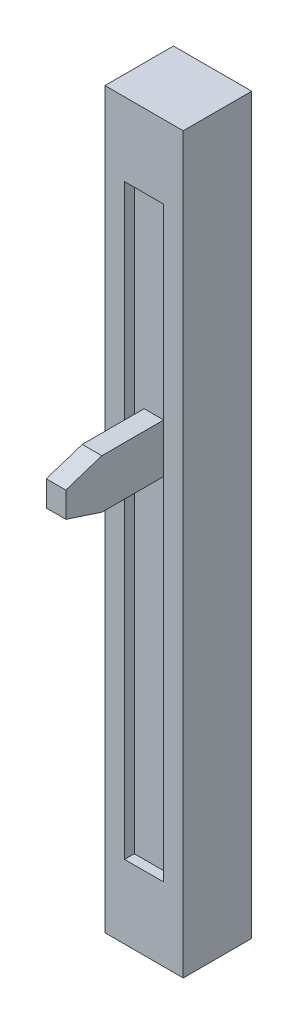
ISO-10303-21;
HEADER;
FILE_DESCRIPTION(('STEP AP214'),'2;1');
FILE_NAME('part.step','',(''),(''),'','','');
FILE_SCHEMA(('AUTOMOTIVE_DESIGN { 1 0 10303 214 1 1 1 1 }'));
ENDSEC;
DATA;
#1=APPLICATION_CONTEXT('core data for automotive mechanical design processes');
#2=APPLICATION_PROTOCOL_DEFINITION('international standard','automotive_design',2000,#1);
#3=PRODUCT_CONTEXT('',#1,'mechanical');
#4=PRODUCT('Part','Part','',(#3));
#5=PRODUCT_RELATED_PRODUCT_CATEGORY('part','',(#4));
#6=PRODUCT_DEFINITION_FORMATION('','',#4);
#7=PRODUCT_DEFINITION_CONTEXT('part definition',#1,'design');
#8=PRODUCT_DEFINITION('design','',#6,#7);
#9=PRODUCT_DEFINITION_SHAPE('','',#8);
#10=(LENGTH_UNIT() NAMED_UNIT(*) SI_UNIT(.MILLI.,.METRE.));
#11=(NAMED_UNIT(*) PLANE_ANGLE_UNIT() SI_UNIT($,.RADIAN.));
#12=(NAMED_UNIT(*) SI_UNIT($,.STERADIAN.) SOLID_ANGLE_UNIT());
#13=UNCERTAINTY_MEASURE_WITH_UNIT(LENGTH_MEASURE(1.E-05),#10,'distance_accuracy_value','');
#14=(GEOMETRIC_REPRESENTATION_CONTEXT(3) GLOBAL_UNCERTAINTY_ASSIGNED_CONTEXT((#13)) GLOBAL_UNIT_ASSIGNED_CONTEXT((#10,
#11,#12)) REPRESENTATION_CONTEXT('',''));
#15=CARTESIAN_POINT('',(0.,0.,0.));
#16=DIRECTION('',(0.,0.,1.));
#17=DIRECTION('',(1.,0.,0.));
#18=AXIS2_PLACEMENT_3D('',#15,#16,#17);
#19=CARTESIAN_POINT('',(4.,-37.5,7.));
#20=DIRECTION('',(-1.,0.,0.));
#21=DIRECTION('',(0.,0.,1.));
#22=AXIS2_PLACEMENT_3D('',#19,#20,#21);
#23=PLANE('',#22);
#24=DIRECTION('',(0.,1.,0.));
#25=VECTOR('',#24,1.);
#26=CARTESIAN_POINT('',(4.,-37.5,0.));
#27=LINE('',#26,#25);
#28=CARTESIAN_POINT('',(4.,-37.5,0.));
#29=VERTEX_POINT('',#28);
#30=CARTESIAN_POINT('',(4.,37.5,0.));
#31=VERTEX_POINT('',#30);
#32=EDGE_CURVE('E197',#29,#31,#27,.T.);
#33=ORIENTED_EDGE('',*,*,#32,.T.);
#34=DIRECTION('',(0.,0.,-1.));
#35=VECTOR('',#34,1.);
#36=CARTESIAN_POINT('',(4.,37.5,7.));
#37=LINE('',#36,#35);
#38=CARTESIAN_POINT('',(4.,37.5,7.));
#39=VERTEX_POINT('',#38);
#40=EDGE_CURVE('E230',#39,#31,#37,.T.);
#41=ORIENTED_EDGE('',*,*,#40,.F.);
#42=DIRECTION('',(0.,1.,0.));
#43=VECTOR('',#42,1.);
#44=CARTESIAN_POINT('',(4.,-37.5,7.));
#45=LINE('',#44,#43);
#46=CARTESIAN_POINT('',(4.,-37.5,7.));
#47=VERTEX_POINT('',#46);
#48=EDGE_CURVE('E204',#47,#39,#45,.T.);
#49=ORIENTED_EDGE('',*,*,#48,.F.);
#50=DIRECTION('',(0.,0.,-1.));
#51=VECTOR('',#50,1.);
#52=CARTESIAN_POINT('',(4.,-37.5,7.));
#53=LINE('',#52,#51);
#54=EDGE_CURVE('E214',#47,#29,#53,.T.);
#55=ORIENTED_EDGE('',*,*,#54,.T.);
#56=EDGE_LOOP('',(#33,#41,#49,#55));
#57=FACE_BOUND('',#56,.T.);
#58=ADVANCED_FACE('F31',(#57),#23,.F.);
#59=CARTESIAN_POINT('',(-4.,37.5,7.));
#60=DIRECTION('',(0.,-1.,0.));
#61=DIRECTION('',(0.,0.,-1.));
#62=AXIS2_PLACEMENT_3D('',#59,#60,#61);
#63=PLANE('',#62);
#64=DIRECTION('',(-1.,0.,0.));
#65=VECTOR('',#64,1.);
#66=CARTESIAN_POINT('',(-4.,37.5,0.));
#67=LINE('',#66,#65);
#68=CARTESIAN_POINT('',(-4.,37.5,0.));
#69=VERTEX_POINT('',#68);
#70=EDGE_CURVE('E217',#31,#69,#67,.T.);
#71=ORIENTED_EDGE('',*,*,#70,.T.);
#72=DIRECTION('',(0.,0.,-1.));
#73=VECTOR('',#72,1.);
#74=CARTESIAN_POINT('',(-4.,37.5,7.));
#75=LINE('',#74,#73);
#76=CARTESIAN_POINT('',(-4.,37.5,7.));
#77=VERTEX_POINT('',#76);
#78=EDGE_CURVE('E227',#77,#69,#75,.T.);
#79=ORIENTED_EDGE('',*,*,#78,.F.);
#80=DIRECTION('',(-1.,0.,0.));
#81=VECTOR('',#80,1.);
#82=CARTESIAN_POINT('',(-4.,37.5,7.));
#83=LINE('',#82,#81);
#84=EDGE_CURVE('E207',#39,#77,#83,.T.);
#85=ORIENTED_EDGE('',*,*,#84,.F.);
#86=ORIENTED_EDGE('',*,*,#40,.T.);
#87=EDGE_LOOP('',(#71,#79,#85,#86));
#88=FACE_BOUND('',#87,.T.);
#89=ADVANCED_FACE('F287',(#88),#63,.F.);
#90=CARTESIAN_POINT('',(-4.,-37.5,7.));
#91=DIRECTION('',(1.,0.,0.));
#92=DIRECTION('',(0.,0.,-1.));
#93=AXIS2_PLACEMENT_3D('',#90,#91,#92);
#94=PLANE('',#93);
#95=DIRECTION('',(0.,-1.,0.));
#96=VECTOR('',#95,1.);
#97=CARTESIAN_POINT('',(-4.,-37.5,0.));
#98=LINE('',#97,#96);
#99=CARTESIAN_POINT('',(-4.,-37.5,0.));
#100=VERTEX_POINT('',#99);
#101=EDGE_CURVE('E219',#69,#100,#98,.T.);
#102=ORIENTED_EDGE('',*,*,#101,.T.);
#103=DIRECTION('',(0.,0.,-1.));
#104=VECTOR('',#103,1.);
#105=CARTESIAN_POINT('',(-4.,-37.5,7.));
#106=LINE('',#105,#104);
#107=CARTESIAN_POINT('',(-4.,-37.5,7.));
#108=VERTEX_POINT('',#107);
#109=EDGE_CURVE('E224',#108,#100,#106,.T.);
#110=ORIENTED_EDGE('',*,*,#109,.F.);
#111=DIRECTION('',(0.,-1.,0.));
#112=VECTOR('',#111,1.);
#113=CARTESIAN_POINT('',(-4.,-37.5,7.));
#114=LINE('',#113,#112);
#115=EDGE_CURVE('E210',#77,#108,#114,.T.);
#116=ORIENTED_EDGE('',*,*,#115,.F.);
#117=ORIENTED_EDGE('',*,*,#78,.T.);
#118=EDGE_LOOP('',(#102,#110,#116,#117));
#119=FACE_BOUND('',#118,.T.);
#120=ADVANCED_FACE('F292',(#119),#94,.F.);
#121=CARTESIAN_POINT('',(-4.,-37.5,7.));
#122=DIRECTION('',(0.,1.,0.));
#123=DIRECTION('',(0.,0.,1.));
#124=AXIS2_PLACEMENT_3D('',#121,#122,#123);
#125=PLANE('',#124);
#126=DIRECTION('',(1.,0.,0.));
#127=VECTOR('',#126,1.);
#128=CARTESIAN_POINT('',(-4.,-37.5,0.));
#129=LINE('',#128,#127);
#130=EDGE_CURVE('E208',#100,#29,#129,.T.);
#131=ORIENTED_EDGE('',*,*,#130,.T.);
#132=ORIENTED_EDGE('',*,*,#54,.F.);
#133=DIRECTION('',(1.,0.,0.));
#134=VECTOR('',#133,1.);
#135=CARTESIAN_POINT('',(-4.,-37.5,7.));
#136=LINE('',#135,#134);
#137=EDGE_CURVE('E212',#108,#47,#136,.T.);
#138=ORIENTED_EDGE('',*,*,#137,.F.);
#139=ORIENTED_EDGE('',*,*,#109,.T.);
#140=EDGE_LOOP('',(#131,#132,#138,#139));
#141=FACE_BOUND('',#140,.T.);
#142=ADVANCED_FACE('F277',(#141),#125,.F.);
#143=CARTESIAN_POINT('',(4.,37.5,7.));
#144=DIRECTION('',(0.,0.,-1.));
#145=DIRECTION('',(-1.,0.,0.));
#146=AXIS2_PLACEMENT_3D('',#143,#144,#145);
#147=PLANE('',#146);
#148=DIRECTION('',(-1.,0.,0.));
#149=VECTOR('',#148,1.);
#150=CARTESIAN_POINT('',(-2.,30.,7.));
#151=LINE('',#150,#149);
#152=CARTESIAN_POINT('',(2.,30.,7.));
#153=VERTEX_POINT('',#152);
#154=CARTESIAN_POINT('',(-2.,30.,7.));
#155=VERTEX_POINT('',#154);
#156=EDGE_CURVE('E187',#153,#155,#151,.T.);
#157=ORIENTED_EDGE('',*,*,#156,.F.);
#158=DIRECTION('',(0.,1.,0.));
#159=VECTOR('',#158,1.);
#160=CARTESIAN_POINT('',(2.,-30.,7.));
#161=LINE('',#160,#159);
#162=CARTESIAN_POINT('',(2.,-30.,7.));
#163=VERTEX_POINT('',#162);
#164=EDGE_CURVE('E142',#163,#153,#161,.T.);
#165=ORIENTED_EDGE('',*,*,#164,.F.);
#166=DIRECTION('',(1.,0.,0.));
#167=VECTOR('',#166,1.);
#168=CARTESIAN_POINT('',(-2.,-30.,7.));
#169=LINE('',#168,#167);
#170=CARTESIAN_POINT('',(-2.,-30.,7.));
#171=VERTEX_POINT('',#170);
#172=EDGE_CURVE('E176',#171,#163,#169,.T.);
#173=ORIENTED_EDGE('',*,*,#172,.F.);
#174=DIRECTION('',(0.,-1.,0.));
#175=VECTOR('',#174,1.);
#176=CARTESIAN_POINT('',(-2.,-30.,7.));
#177=LINE('',#176,#175);
#178=EDGE_CURVE('E190',#155,#171,#177,.T.);
#179=ORIENTED_EDGE('',*,*,#178,.F.);
#180=EDGE_LOOP('',(#157,#165,#173,#179));
#181=FACE_BOUND('',#180,.T.);
#182=ORIENTED_EDGE('',*,*,#48,.T.);
#183=ORIENTED_EDGE('',*,*,#84,.T.);
#184=ORIENTED_EDGE('',*,*,#115,.T.);
#185=ORIENTED_EDGE('',*,*,#137,.T.);
#186=EDGE_LOOP('',(#182,#183,#184,#185));
#187=FACE_BOUND('',#186,.T.);
#188=ADVANCED_FACE('F273',(#181,#187),#147,.F.);
#189=CARTESIAN_POINT('',(4.,37.5,0.));
#190=DIRECTION('',(0.,0.,-1.));
#191=DIRECTION('',(-1.,0.,0.));
#192=AXIS2_PLACEMENT_3D('',#189,#190,#191);
#193=PLANE('',#192);
#194=ORIENTED_EDGE('',*,*,#32,.F.);
#195=ORIENTED_EDGE('',*,*,#130,.F.);
#196=ORIENTED_EDGE('',*,*,#101,.F.);
#197=ORIENTED_EDGE('',*,*,#70,.F.);
#198=EDGE_LOOP('',(#194,#195,#196,#197));
#199=FACE_BOUND('',#198,.T.);
#200=ADVANCED_FACE('F276',(#199),#193,.T.);
#201=CARTESIAN_POINT('',(2.,-30.,6.));
#202=DIRECTION('',(1.,0.,0.));
#203=DIRECTION('',(0.,0.,-1.));
#204=AXIS2_PLACEMENT_3D('',#201,#202,#203);
#205=PLANE('',#204);
#206=ORIENTED_EDGE('',*,*,#164,.T.);
#207=DIRECTION('',(0.,0.,1.));
#208=VECTOR('',#207,1.);
#209=CARTESIAN_POINT('',(2.,30.,6.));
#210=LINE('',#209,#208);
#211=CARTESIAN_POINT('',(2.,30.,6.));
#212=VERTEX_POINT('',#211);
#213=EDGE_CURVE('E185',#212,#153,#210,.T.);
#214=ORIENTED_EDGE('',*,*,#213,.F.);
#215=DIRECTION('',(0.,1.,0.));
#216=VECTOR('',#215,1.);
#217=CARTESIAN_POINT('',(2.,-30.,6.));
#218=LINE('',#217,#216);
#219=CARTESIAN_POINT('',(2.,-30.,6.));
#220=VERTEX_POINT('',#219);
#221=EDGE_CURVE('E172',#220,#212,#218,.T.);
#222=ORIENTED_EDGE('',*,*,#221,.F.);
#223=DIRECTION('',(0.,0.,1.));
#224=VECTOR('',#223,1.);
#225=CARTESIAN_POINT('',(2.,-30.,6.));
#226=LINE('',#225,#224);
#227=EDGE_CURVE('E195',#220,#163,#226,.T.);
#228=ORIENTED_EDGE('',*,*,#227,.T.);
#229=EDGE_LOOP('',(#206,#214,#222,#228));
#230=FACE_BOUND('',#229,.T.);
#231=ADVANCED_FACE('F261',(#230),#205,.F.);
#232=CARTESIAN_POINT('',(-2.,-30.,6.));
#233=DIRECTION('',(0.,-1.,0.));
#234=DIRECTION('',(0.,0.,-1.));
#235=AXIS2_PLACEMENT_3D('',#232,#233,#234);
#236=PLANE('',#235);
#237=ORIENTED_EDGE('',*,*,#172,.T.);
#238=ORIENTED_EDGE('',*,*,#227,.F.);
#239=DIRECTION('',(1.,0.,0.));
#240=VECTOR('',#239,1.);
#241=CARTESIAN_POINT('',(-2.,-30.,6.));
#242=LINE('',#241,#240);
#243=CARTESIAN_POINT('',(-2.,-30.,6.));
#244=VERTEX_POINT('',#243);
#245=EDGE_CURVE('E182',#244,#220,#242,.T.);
#246=ORIENTED_EDGE('',*,*,#245,.F.);
#247=DIRECTION('',(0.,0.,1.));
#248=VECTOR('',#247,1.);
#249=CARTESIAN_POINT('',(-2.,-30.,6.));
#250=LINE('',#249,#248);
#251=EDGE_CURVE('E198',#244,#171,#250,.T.);
#252=ORIENTED_EDGE('',*,*,#251,.T.);
#253=EDGE_LOOP('',(#237,#238,#246,#252));
#254=FACE_BOUND('',#253,.T.);
#255=ADVANCED_FACE('F270',(#254),#236,.F.);
#256=CARTESIAN_POINT('',(-2.,-30.,6.));
#257=DIRECTION('',(-1.,0.,0.));
#258=DIRECTION('',(0.,0.,1.));
#259=AXIS2_PLACEMENT_3D('',#256,#257,#258);
#260=PLANE('',#259);
#261=ORIENTED_EDGE('',*,*,#178,.T.);
#262=ORIENTED_EDGE('',*,*,#251,.F.);
#263=DIRECTION('',(0.,-1.,0.));
#264=VECTOR('',#263,1.);
#265=CARTESIAN_POINT('',(-2.,-30.,6.));
#266=LINE('',#265,#264);
#267=CARTESIAN_POINT('',(-2.,30.,6.));
#268=VERTEX_POINT('',#267);
#269=EDGE_CURVE('E179',#268,#244,#266,.T.);
#270=ORIENTED_EDGE('',*,*,#269,.F.);
#271=DIRECTION('',(0.,0.,1.));
#272=VECTOR('',#271,1.);
#273=CARTESIAN_POINT('',(-2.,30.,6.));
#274=LINE('',#273,#272);
#275=EDGE_CURVE('E200',#268,#155,#274,.T.);
#276=ORIENTED_EDGE('',*,*,#275,.T.);
#277=EDGE_LOOP('',(#261,#262,#270,#276));
#278=FACE_BOUND('',#277,.T.);
#279=ADVANCED_FACE('F268',(#278),#260,.F.);
#280=CARTESIAN_POINT('',(-2.,30.,6.));
#281=DIRECTION('',(0.,1.,0.));
#282=DIRECTION('',(0.,0.,1.));
#283=AXIS2_PLACEMENT_3D('',#280,#281,#282);
#284=PLANE('',#283);
#285=ORIENTED_EDGE('',*,*,#156,.T.);
#286=ORIENTED_EDGE('',*,*,#275,.F.);
#287=DIRECTION('',(-1.,0.,0.));
#288=VECTOR('',#287,1.);
#289=CARTESIAN_POINT('',(-2.,30.,6.));
#290=LINE('',#289,#288);
#291=EDGE_CURVE('E175',#212,#268,#290,.T.);
#292=ORIENTED_EDGE('',*,*,#291,.F.);
#293=ORIENTED_EDGE('',*,*,#213,.T.);
#294=EDGE_LOOP('',(#285,#286,#292,#293));
#295=FACE_BOUND('',#294,.T.);
#296=ADVANCED_FACE('F255',(#295),#284,.F.);
#297=CARTESIAN_POINT('',(2.,30.,6.));
#298=DIRECTION('',(0.,0.,-1.));
#299=DIRECTION('',(-1.,0.,0.));
#300=AXIS2_PLACEMENT_3D('',#297,#298,#299);
#301=PLANE('',#300);
#302=DIRECTION('',(-1.,0.,0.));
#303=VECTOR('',#302,1.);
#304=CARTESIAN_POINT('',(2.,9.89513065053888,6.));
#305=LINE('',#304,#303);
#306=CARTESIAN_POINT('',(1.,9.89513065053888,6.));
#307=VERTEX_POINT('',#306);
#308=CARTESIAN_POINT('',(-1.,9.89513065053888,6.));
#309=VERTEX_POINT('',#308);
#310=EDGE_CURVE('E38',#307,#309,#305,.T.);
#311=ORIENTED_EDGE('',*,*,#310,.F.);
#312=DIRECTION('',(0.,-1.,0.));
#313=VECTOR('',#312,1.);
#314=CARTESIAN_POINT('',(1.,30.,6.));
#315=LINE('',#314,#313);
#316=CARTESIAN_POINT('',(1.,4.89513065053888,6.));
#317=VERTEX_POINT('',#316);
#318=EDGE_CURVE('E11',#307,#317,#315,.T.);
#319=ORIENTED_EDGE('',*,*,#318,.T.);
#320=DIRECTION('',(1.,0.,0.));
#321=VECTOR('',#320,1.);
#322=CARTESIAN_POINT('',(2.,4.89513065053888,6.));
#323=LINE('',#322,#321);
#324=CARTESIAN_POINT('',(-1.,4.89513065053888,6.));
#325=VERTEX_POINT('',#324);
#326=EDGE_CURVE('E236',#325,#317,#323,.T.);
#327=ORIENTED_EDGE('',*,*,#326,.F.);
#328=DIRECTION('',(0.,-1.,0.));
#329=VECTOR('',#328,1.);
#330=CARTESIAN_POINT('',(-1.,30.,6.));
#331=LINE('',#330,#329);
#332=EDGE_CURVE('E233',#309,#325,#331,.T.);
#333=ORIENTED_EDGE('',*,*,#332,.F.);
#334=EDGE_LOOP('',(#311,#319,#327,#333));
#335=FACE_BOUND('',#334,.T.);
#336=ORIENTED_EDGE('',*,*,#221,.T.);
#337=ORIENTED_EDGE('',*,*,#291,.T.);
#338=ORIENTED_EDGE('',*,*,#269,.T.);
#339=ORIENTED_EDGE('',*,*,#245,.T.);
#340=EDGE_LOOP('',(#336,#337,#338,#339));
#341=FACE_BOUND('',#340,.T.);
#342=ADVANCED_FACE('F252',(#335,#341),#301,.F.);
#343=CARTESIAN_POINT('',(1.,9.89513065053888,5.36292624789573));
#344=DIRECTION('',(0.,-1.,0.));
#345=DIRECTION('',(0.,0.,-1.));
#346=AXIS2_PLACEMENT_3D('',#343,#344,#345);
#347=PLANE('',#346);
#348=DIRECTION('',(0.,0.,1.));
#349=VECTOR('',#348,1.);
#350=CARTESIAN_POINT('',(1.,9.89513065053888,5.36292624789573));
#351=LINE('',#350,#349);
#352=CARTESIAN_POINT('',(1.,9.89513065053888,12.3255520101537));
#353=VERTEX_POINT('',#352);
#354=EDGE_CURVE('E125',#307,#353,#351,.T.);
#355=ORIENTED_EDGE('',*,*,#354,.F.);
#356=ORIENTED_EDGE('',*,*,#310,.T.);
#357=DIRECTION('',(0.,0.,1.));
#358=VECTOR('',#357,1.);
#359=CARTESIAN_POINT('',(-1.,9.89513065053888,5.36292624789573));
#360=LINE('',#359,#358);
#361=CARTESIAN_POINT('',(-1.,9.89513065053888,12.3255520101537));
#362=VERTEX_POINT('',#361);
#363=EDGE_CURVE('E139',#309,#362,#360,.T.);
#364=ORIENTED_EDGE('',*,*,#363,.T.);
#365=DIRECTION('',(-1.,0.,0.));
#366=VECTOR('',#365,1.);
#367=CARTESIAN_POINT('',(1.,9.89513065053888,12.3255520101537));
#368=LINE('',#367,#366);
#369=EDGE_CURVE('E136',#353,#362,#368,.T.);
#370=ORIENTED_EDGE('',*,*,#369,.F.);
#371=EDGE_LOOP('',(#355,#356,#364,#370));
#372=FACE_BOUND('',#371,.T.);
#373=ADVANCED_FACE('F137',(#372),#347,.F.);
#374=CARTESIAN_POINT('',(1.,4.89513065053888,12.3255520101537));
#375=DIRECTION('',(0.,1.,0.));
#376=DIRECTION('',(0.,0.,1.));
#377=AXIS2_PLACEMENT_3D('',#374,#375,#376);
#378=PLANE('',#377);
#379=DIRECTION('',(0.,0.,-1.));
#380=VECTOR('',#379,1.);
#381=CARTESIAN_POINT('',(-1.,4.89513065053888,12.3255520101537));
#382=LINE('',#381,#380);
#383=CARTESIAN_POINT('',(-1.,4.89513065053888,12.3255520101537));
#384=VERTEX_POINT('',#383);
#385=EDGE_CURVE('E133',#384,#325,#382,.T.);
#386=ORIENTED_EDGE('',*,*,#385,.T.);
#387=ORIENTED_EDGE('',*,*,#326,.T.);
#388=DIRECTION('',(0.,0.,-1.));
#389=VECTOR('',#388,1.);
#390=CARTESIAN_POINT('',(1.,4.89513065053888,12.3255520101537));
#391=LINE('',#390,#389);
#392=CARTESIAN_POINT('',(1.,4.89513065053888,12.3255520101537));
#393=VERTEX_POINT('',#392);
#394=EDGE_CURVE('E154',#393,#317,#391,.T.);
#395=ORIENTED_EDGE('',*,*,#394,.F.);
#396=DIRECTION('',(-1.,0.,0.));
#397=VECTOR('',#396,1.);
#398=CARTESIAN_POINT('',(1.,4.89513065053888,12.3255520101537));
#399=LINE('',#398,#397);
#400=EDGE_CURVE('E156',#393,#384,#399,.T.);
#401=ORIENTED_EDGE('',*,*,#400,.T.);
#402=EDGE_LOOP('',(#386,#387,#395,#401));
#403=FACE_BOUND('',#402,.T.);
#404=ADVANCED_FACE('F251',(#403),#378,.F.);
#405=CARTESIAN_POINT('',(1.,9.89513065053888,5.36292624789573));
#406=DIRECTION('',(1.,0.,0.));
#407=DIRECTION('',(0.,0.,-1.));
#408=AXIS2_PLACEMENT_3D('',#405,#406,#407);
#409=PLANE('',#408);
#410=ORIENTED_EDGE('',*,*,#318,.F.);
#411=ORIENTED_EDGE('',*,*,#354,.T.);
#412=DIRECTION('',(0.,-0.311811011616484,0.950144143293377));
#413=VECTOR('',#412,1.);
#414=CARTESIAN_POINT('',(1.,9.89513065053888,12.3255520101537));
#415=LINE('',#414,#413);
#416=CARTESIAN_POINT('',(1.,8.68927851438319,16.));
#417=VERTEX_POINT('',#416);
#418=EDGE_CURVE('E129',#353,#417,#415,.T.);
#419=ORIENTED_EDGE('',*,*,#418,.T.);
#420=DIRECTION('',(0.,-1.,0.));
#421=VECTOR('',#420,1.);
#422=CARTESIAN_POINT('',(1.,8.68927851438319,16.));
#423=LINE('',#422,#421);
#424=CARTESIAN_POINT('',(1.,6.10098278669458,16.));
#425=VERTEX_POINT('',#424);
#426=EDGE_CURVE('E148',#417,#425,#423,.T.);
#427=ORIENTED_EDGE('',*,*,#426,.T.);
#428=DIRECTION('',(0.,-0.311811011616483,-0.950144143293377));
#429=VECTOR('',#428,1.);
#430=CARTESIAN_POINT('',(1.,6.10098278669458,16.));
#431=LINE('',#430,#429);
#432=EDGE_CURVE('E150',#425,#393,#431,.T.);
#433=ORIENTED_EDGE('',*,*,#432,.T.);
#434=ORIENTED_EDGE('',*,*,#394,.T.);
#435=EDGE_LOOP('',(#410,#411,#419,#427,#433,#434));
#436=FACE_BOUND('',#435,.T.);
#437=ADVANCED_FACE('F127',(#436),#409,.T.);
#438=CARTESIAN_POINT('',(-1.,9.89513065053888,5.36292624789573));
#439=DIRECTION('',(1.,0.,0.));
#440=DIRECTION('',(0.,0.,-1.));
#441=AXIS2_PLACEMENT_3D('',#438,#439,#440);
#442=PLANE('',#441);
#443=ORIENTED_EDGE('',*,*,#363,.F.);
#444=ORIENTED_EDGE('',*,*,#332,.T.);
#445=ORIENTED_EDGE('',*,*,#385,.F.);
#446=DIRECTION('',(0.,-0.311811011616483,-0.950144143293377));
#447=VECTOR('',#446,1.);
#448=CARTESIAN_POINT('',(-1.,6.10098278669458,16.));
#449=LINE('',#448,#447);
#450=CARTESIAN_POINT('',(-1.,6.10098278669458,16.));
#451=VERTEX_POINT('',#450);
#452=EDGE_CURVE('E162',#451,#384,#449,.T.);
#453=ORIENTED_EDGE('',*,*,#452,.F.);
#454=DIRECTION('',(0.,-1.,0.));
#455=VECTOR('',#454,1.);
#456=CARTESIAN_POINT('',(-1.,8.68927851438319,16.));
#457=LINE('',#456,#455);
#458=CARTESIAN_POINT('',(-1.,8.68927851438319,16.));
#459=VERTEX_POINT('',#458);
#460=EDGE_CURVE('E160',#459,#451,#457,.T.);
#461=ORIENTED_EDGE('',*,*,#460,.F.);
#462=DIRECTION('',(0.,-0.311811011616484,0.950144143293377));
#463=VECTOR('',#462,1.);
#464=CARTESIAN_POINT('',(-1.,9.89513065053888,12.3255520101537));
#465=LINE('',#464,#463);
#466=EDGE_CURVE('E158',#362,#459,#465,.T.);
#467=ORIENTED_EDGE('',*,*,#466,.F.);
#468=EDGE_LOOP('',(#443,#444,#445,#453,#461,#467));
#469=FACE_BOUND('',#468,.T.);
#470=ADVANCED_FACE('F238',(#469),#442,.F.);
#471=CARTESIAN_POINT('',(1.,9.89513065053888,12.3255520101537));
#472=DIRECTION('',(0.,-0.950144143293377,-0.311811011616484));
#473=DIRECTION('',(0.,0.311811011616484,-0.950144143293377));
#474=AXIS2_PLACEMENT_3D('',#471,#472,#473);
#475=PLANE('',#474);
#476=ORIENTED_EDGE('',*,*,#466,.T.);
#477=DIRECTION('',(-1.,0.,0.));
#478=VECTOR('',#477,1.);
#479=CARTESIAN_POINT('',(1.,8.68927851438319,16.));
#480=LINE('',#479,#478);
#481=EDGE_CURVE('E143',#417,#459,#480,.T.);
#482=ORIENTED_EDGE('',*,*,#481,.F.);
#483=ORIENTED_EDGE('',*,*,#418,.F.);
#484=ORIENTED_EDGE('',*,*,#369,.T.);
#485=EDGE_LOOP('',(#476,#482,#483,#484));
#486=FACE_BOUND('',#485,.T.);
#487=ADVANCED_FACE('F145',(#486),#475,.F.);
#488=CARTESIAN_POINT('',(1.,8.68927851438319,16.));
#489=DIRECTION('',(0.,0.,-1.));
#490=DIRECTION('',(-1.,0.,0.));
#491=AXIS2_PLACEMENT_3D('',#488,#489,#490);
#492=PLANE('',#491);
#493=ORIENTED_EDGE('',*,*,#460,.T.);
#494=DIRECTION('',(-1.,0.,0.));
#495=VECTOR('',#494,1.);
#496=CARTESIAN_POINT('',(1.,6.10098278669458,16.));
#497=LINE('',#496,#495);
#498=EDGE_CURVE('E168',#425,#451,#497,.T.);
#499=ORIENTED_EDGE('',*,*,#498,.F.);
#500=ORIENTED_EDGE('',*,*,#426,.F.);
#501=ORIENTED_EDGE('',*,*,#481,.T.);
#502=EDGE_LOOP('',(#493,#499,#500,#501));
#503=FACE_BOUND('',#502,.T.);
#504=ADVANCED_FACE('F243',(#503),#492,.F.);
#505=CARTESIAN_POINT('',(1.,6.10098278669458,16.));
#506=DIRECTION('',(0.,0.950144143293377,-0.311811011616483));
#507=DIRECTION('',(0.,0.311811011616483,0.950144143293377));
#508=AXIS2_PLACEMENT_3D('',#505,#506,#507);
#509=PLANE('',#508);
#510=ORIENTED_EDGE('',*,*,#452,.T.);
#511=ORIENTED_EDGE('',*,*,#400,.F.);
#512=ORIENTED_EDGE('',*,*,#432,.F.);
#513=ORIENTED_EDGE('',*,*,#498,.T.);
#514=EDGE_LOOP('',(#510,#511,#512,#513));
#515=FACE_BOUND('',#514,.T.);
#516=ADVANCED_FACE('F249',(#515),#509,.F.);
#517=CLOSED_SHELL('',(#58,#89,#120,#142,#188,#200,#231,#255,#279,#296,#342,#373,#404,#437,#470,
#487,#504,#516));
#518=MANIFOLD_SOLID_BREP('B2',#517);
#519=ADVANCED_BREP_SHAPE_REPRESENTATION('',(#18,#518),#14);
#520=SHAPE_DEFINITION_REPRESENTATION(#9,#519);
ENDSEC;
END-ISO-10303-21;
